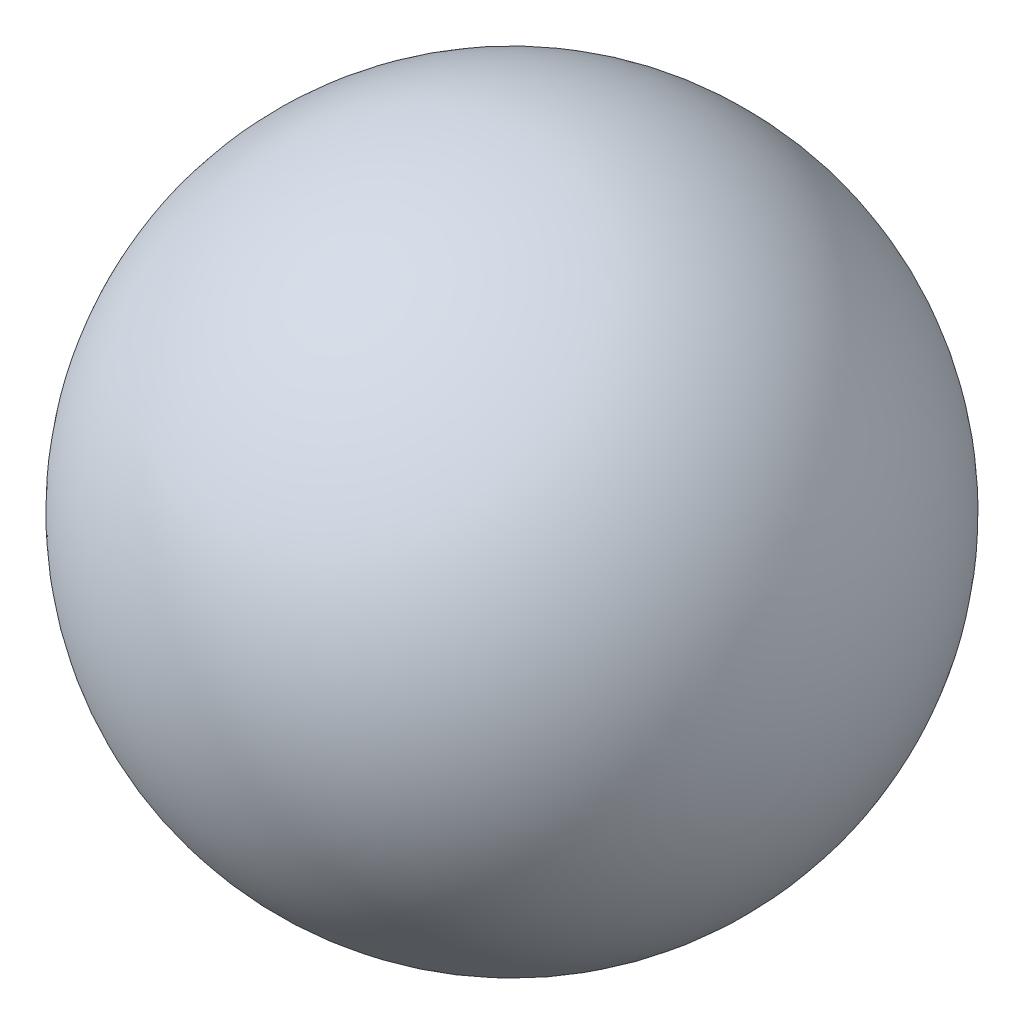
ISO-10303-21;
HEADER;
FILE_DESCRIPTION(('STEP AP214'),'2;1');
FILE_NAME('part.step','',(''),(''),'','','');
FILE_SCHEMA(('AUTOMOTIVE_DESIGN { 1 0 10303 214 1 1 1 1 }'));
ENDSEC;
DATA;
#1=APPLICATION_CONTEXT('core data for automotive mechanical design processes');
#2=APPLICATION_PROTOCOL_DEFINITION('international standard','automotive_design',2000,#1);
#3=PRODUCT_CONTEXT('',#1,'mechanical');
#4=PRODUCT('Part','Part','',(#3));
#5=PRODUCT_RELATED_PRODUCT_CATEGORY('part','',(#4));
#6=PRODUCT_DEFINITION_FORMATION('','',#4);
#7=PRODUCT_DEFINITION_CONTEXT('part definition',#1,'design');
#8=PRODUCT_DEFINITION('design','',#6,#7);
#9=PRODUCT_DEFINITION_SHAPE('','',#8);
#10=(LENGTH_UNIT() NAMED_UNIT(*) SI_UNIT(.MILLI.,.METRE.));
#11=(NAMED_UNIT(*) PLANE_ANGLE_UNIT() SI_UNIT($,.RADIAN.));
#12=(NAMED_UNIT(*) SI_UNIT($,.STERADIAN.) SOLID_ANGLE_UNIT());
#13=UNCERTAINTY_MEASURE_WITH_UNIT(LENGTH_MEASURE(1.E-05),#10,'distance_accuracy_value','');
#14=(GEOMETRIC_REPRESENTATION_CONTEXT(3) GLOBAL_UNCERTAINTY_ASSIGNED_CONTEXT((#13)) GLOBAL_UNIT_ASSIGNED_CONTEXT((#10,
#11,#12)) REPRESENTATION_CONTEXT('',''));
#15=CARTESIAN_POINT('',(0.,0.,0.));
#16=DIRECTION('',(0.,0.,1.));
#17=DIRECTION('',(1.,0.,0.));
#18=AXIS2_PLACEMENT_3D('',#15,#16,#17);
#19=CARTESIAN_POINT('',(0.,0.,0.));
#20=DIRECTION('',(-1.,0.,0.));
#21=DIRECTION('',(0.,1.,0.));
#22=AXIS2_PLACEMENT_3D('',#19,#20,#21);
#23=SPHERICAL_SURFACE('',#22,12.);
#24=CARTESIAN_POINT('',(-12.,0.,0.));
#25=VERTEX_POINT('',#24);
#26=VERTEX_LOOP('',#25);
#27=FACE_BOUND('',#26,.T.);
#28=ADVANCED_FACE('F35',(#27),#23,.T.);
#29=CLOSED_SHELL('',(#28));
#30=MANIFOLD_SOLID_BREP('B2',#29);
#31=ADVANCED_BREP_SHAPE_REPRESENTATION('',(#18,#30),#14);
#32=SHAPE_DEFINITION_REPRESENTATION(#9,#31);
ENDSEC;
END-ISO-10303-21;
